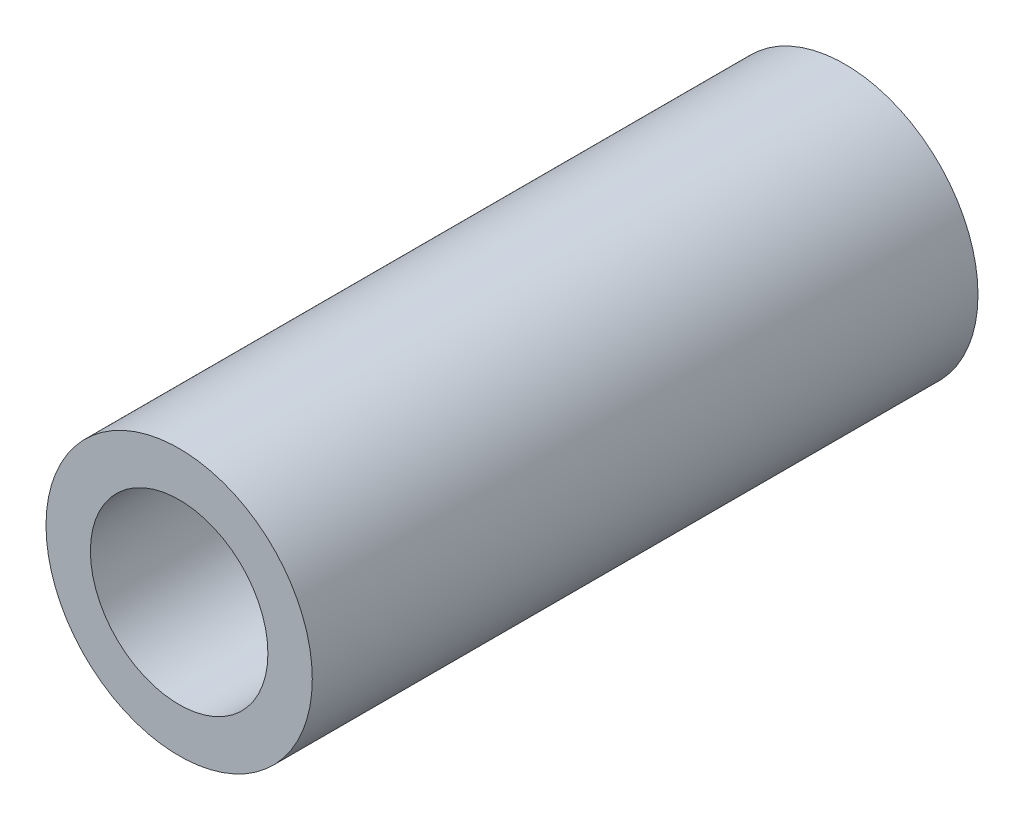
ISO-10303-21;
HEADER;
FILE_DESCRIPTION(('STEP AP214'),'2;1');
FILE_NAME('part.step','',(''),(''),'','','');
FILE_SCHEMA(('AUTOMOTIVE_DESIGN { 1 0 10303 214 1 1 1 1 }'));
ENDSEC;
DATA;
#1=APPLICATION_CONTEXT('core data for automotive mechanical design processes');
#2=APPLICATION_PROTOCOL_DEFINITION('international standard','automotive_design',2000,#1);
#3=PRODUCT_CONTEXT('',#1,'mechanical');
#4=PRODUCT('Part','Part','',(#3));
#5=PRODUCT_RELATED_PRODUCT_CATEGORY('part','',(#4));
#6=PRODUCT_DEFINITION_FORMATION('','',#4);
#7=PRODUCT_DEFINITION_CONTEXT('part definition',#1,'design');
#8=PRODUCT_DEFINITION('design','',#6,#7);
#9=PRODUCT_DEFINITION_SHAPE('','',#8);
#10=(LENGTH_UNIT() NAMED_UNIT(*) SI_UNIT(.MILLI.,.METRE.));
#11=(NAMED_UNIT(*) PLANE_ANGLE_UNIT() SI_UNIT($,.RADIAN.));
#12=(NAMED_UNIT(*) SI_UNIT($,.STERADIAN.) SOLID_ANGLE_UNIT());
#13=UNCERTAINTY_MEASURE_WITH_UNIT(LENGTH_MEASURE(1.E-05),#10,'distance_accuracy_value','');
#14=(GEOMETRIC_REPRESENTATION_CONTEXT(3) GLOBAL_UNCERTAINTY_ASSIGNED_CONTEXT((#13)) GLOBAL_UNIT_ASSIGNED_CONTEXT((#10,
#11,#12)) REPRESENTATION_CONTEXT('',''));
#15=CARTESIAN_POINT('',(0.,0.,0.));
#16=DIRECTION('',(0.,0.,1.));
#17=DIRECTION('',(1.,0.,0.));
#18=AXIS2_PLACEMENT_3D('',#15,#16,#17);
#19=CARTESIAN_POINT('',(0.,0.,38.1));
#20=DIRECTION('',(0.,0.,1.));
#21=DIRECTION('',(1.,0.,0.));
#22=AXIS2_PLACEMENT_3D('',#19,#20,#21);
#23=PLANE('',#22);
#24=CARTESIAN_POINT('',(0.,0.,38.1));
#25=DIRECTION('',(0.,0.,1.));
#26=DIRECTION('',(1.,0.,0.));
#27=AXIS2_PLACEMENT_3D('',#24,#25,#26);
#28=CIRCLE('',#27,7.62);
#29=CARTESIAN_POINT('',(7.62,0.,38.1));
#30=VERTEX_POINT('',#29);
#31=EDGE_CURVE('E10',#30,#30,#28,.T.);
#32=ORIENTED_EDGE('',*,*,#31,.T.);
#33=EDGE_LOOP('',(#32));
#34=FACE_BOUND('',#33,.T.);
#35=CARTESIAN_POINT('',(0.,0.,38.1));
#36=DIRECTION('',(0.,0.,1.));
#37=DIRECTION('',(1.,0.,0.));
#38=AXIS2_PLACEMENT_3D('',#35,#36,#37);
#39=CIRCLE('',#38,5.08);
#40=CARTESIAN_POINT('',(5.08,0.,38.1));
#41=VERTEX_POINT('',#40);
#42=EDGE_CURVE('E42',#41,#41,#39,.T.);
#43=ORIENTED_EDGE('',*,*,#42,.F.);
#44=EDGE_LOOP('',(#43));
#45=FACE_BOUND('',#44,.T.);
#46=ADVANCED_FACE('F31',(#34,#45),#23,.T.);
#47=CARTESIAN_POINT('',(0.,0.,0.));
#48=DIRECTION('',(0.,0.,1.));
#49=DIRECTION('',(1.,0.,0.));
#50=AXIS2_PLACEMENT_3D('',#47,#48,#49);
#51=PLANE('',#50);
#52=CARTESIAN_POINT('',(0.,0.,0.));
#53=DIRECTION('',(0.,0.,1.));
#54=DIRECTION('',(1.,0.,0.));
#55=AXIS2_PLACEMENT_3D('',#52,#53,#54);
#56=CIRCLE('',#55,7.62);
#57=CARTESIAN_POINT('',(7.62,0.,0.));
#58=VERTEX_POINT('',#57);
#59=EDGE_CURVE('E35',#58,#58,#56,.T.);
#60=ORIENTED_EDGE('',*,*,#59,.F.);
#61=EDGE_LOOP('',(#60));
#62=FACE_BOUND('',#61,.T.);
#63=CARTESIAN_POINT('',(0.,0.,0.));
#64=DIRECTION('',(0.,0.,1.));
#65=DIRECTION('',(1.,0.,0.));
#66=AXIS2_PLACEMENT_3D('',#63,#64,#65);
#67=CIRCLE('',#66,5.08);
#68=CARTESIAN_POINT('',(5.08,0.,0.));
#69=VERTEX_POINT('',#68);
#70=EDGE_CURVE('E44',#69,#69,#67,.T.);
#71=ORIENTED_EDGE('',*,*,#70,.T.);
#72=EDGE_LOOP('',(#71));
#73=FACE_BOUND('',#72,.T.);
#74=ADVANCED_FACE('F54',(#62,#73),#51,.F.);
#75=CARTESIAN_POINT('',(0.,0.,38.1));
#76=DIRECTION('',(0.,0.,-1.));
#77=DIRECTION('',(-1.,0.,0.));
#78=AXIS2_PLACEMENT_3D('',#75,#76,#77);
#79=CYLINDRICAL_SURFACE('',#78,7.62);
#80=ORIENTED_EDGE('',*,*,#31,.F.);
#81=EDGE_LOOP('',(#80));
#82=FACE_BOUND('',#81,.T.);
#83=ORIENTED_EDGE('',*,*,#59,.T.);
#84=EDGE_LOOP('',(#83));
#85=FACE_BOUND('',#84,.T.);
#86=ADVANCED_FACE('F33',(#82,#85),#79,.T.);
#87=CARTESIAN_POINT('',(0.,0.,38.1));
#88=DIRECTION('',(0.,0.,-1.));
#89=DIRECTION('',(-1.,0.,0.));
#90=AXIS2_PLACEMENT_3D('',#87,#88,#89);
#91=CYLINDRICAL_SURFACE('',#90,5.08);
#92=ORIENTED_EDGE('',*,*,#42,.T.);
#93=EDGE_LOOP('',(#92));
#94=FACE_BOUND('',#93,.T.);
#95=ORIENTED_EDGE('',*,*,#70,.F.);
#96=EDGE_LOOP('',(#95));
#97=FACE_BOUND('',#96,.T.);
#98=ADVANCED_FACE('F50',(#94,#97),#91,.F.);
#99=CLOSED_SHELL('',(#46,#74,#86,#98));
#100=MANIFOLD_SOLID_BREP('B2',#99);
#101=ADVANCED_BREP_SHAPE_REPRESENTATION('',(#18,#100),#14);
#102=SHAPE_DEFINITION_REPRESENTATION(#9,#101);
ENDSEC;
END-ISO-10303-21;
